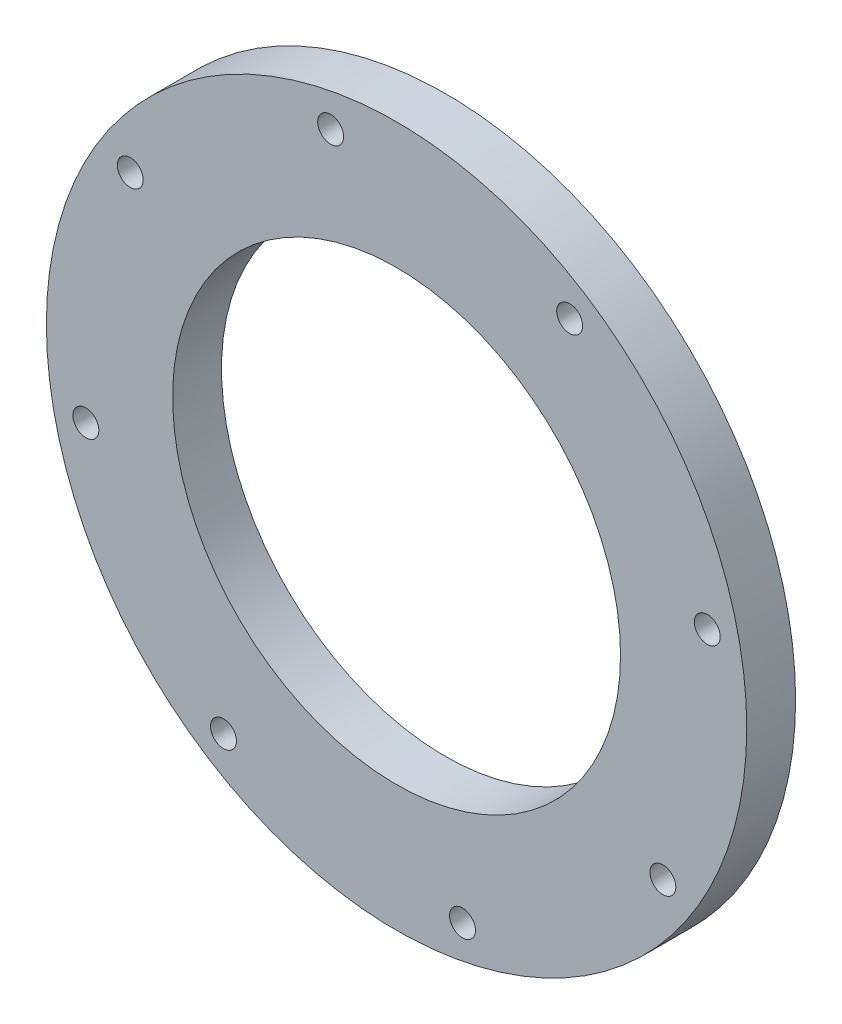
ISO-10303-21;
HEADER;
FILE_DESCRIPTION(('STEP AP214'),'2;1');
FILE_NAME('part.step','',(''),(''),'','','');
FILE_SCHEMA(('AUTOMOTIVE_DESIGN { 1 0 10303 214 1 1 1 1 }'));
ENDSEC;
DATA;
#1=APPLICATION_CONTEXT('core data for automotive mechanical design processes');
#2=APPLICATION_PROTOCOL_DEFINITION('international standard','automotive_design',2000,#1);
#3=PRODUCT_CONTEXT('',#1,'mechanical');
#4=PRODUCT('Part','Part','',(#3));
#5=PRODUCT_RELATED_PRODUCT_CATEGORY('part','',(#4));
#6=PRODUCT_DEFINITION_FORMATION('','',#4);
#7=PRODUCT_DEFINITION_CONTEXT('part definition',#1,'design');
#8=PRODUCT_DEFINITION('design','',#6,#7);
#9=PRODUCT_DEFINITION_SHAPE('','',#8);
#10=(LENGTH_UNIT() NAMED_UNIT(*) SI_UNIT(.MILLI.,.METRE.));
#11=(NAMED_UNIT(*) PLANE_ANGLE_UNIT() SI_UNIT($,.RADIAN.));
#12=(NAMED_UNIT(*) SI_UNIT($,.STERADIAN.) SOLID_ANGLE_UNIT());
#13=UNCERTAINTY_MEASURE_WITH_UNIT(LENGTH_MEASURE(1.E-05),#10,'distance_accuracy_value','');
#14=(GEOMETRIC_REPRESENTATION_CONTEXT(3) GLOBAL_UNCERTAINTY_ASSIGNED_CONTEXT((#13)) GLOBAL_UNIT_ASSIGNED_CONTEXT((#10,
#11,#12)) REPRESENTATION_CONTEXT('',''));
#15=CARTESIAN_POINT('',(0.,0.,0.));
#16=DIRECTION('',(0.,0.,1.));
#17=DIRECTION('',(1.,0.,0.));
#18=AXIS2_PLACEMENT_3D('',#15,#16,#17);
#19=CARTESIAN_POINT('',(0.,0.,7.62));
#20=DIRECTION('',(0.,0.,1.));
#21=DIRECTION('',(1.,0.,0.));
#22=AXIS2_PLACEMENT_3D('',#19,#20,#21);
#23=PLANE('',#22);
#24=CARTESIAN_POINT('',(-10.2805399774577,48.451330196104,7.62));
#25=DIRECTION('',(0.,0.,-1.));
#26=DIRECTION('',(-1.,0.,0.));
#27=AXIS2_PLACEMENT_3D('',#24,#25,#26);
#28=CIRCLE('',#27,2.01929999999999);
#29=CARTESIAN_POINT('',(-12.2998399774577,48.451330196104,7.62));
#30=VERTEX_POINT('',#29);
#31=EDGE_CURVE('E59',#30,#30,#28,.T.);
#32=ORIENTED_EDGE('',*,*,#31,.T.);
#33=EDGE_LOOP('',(#32));
#34=FACE_BOUND('',#33,.T.);
#35=CARTESIAN_POINT('',(26.990824606854,41.5297036714933,7.62));
#36=DIRECTION('',(0.,0.,-1.));
#37=DIRECTION('',(-1.,0.,0.));
#38=AXIS2_PLACEMENT_3D('',#35,#36,#37);
#39=CIRCLE('',#38,2.01929999999998);
#40=CARTESIAN_POINT('',(24.971524606854,41.5297036714933,7.62));
#41=VERTEX_POINT('',#40);
#42=EDGE_CURVE('E78',#41,#41,#39,.T.);
#43=ORIENTED_EDGE('',*,*,#42,.T.);
#44=EDGE_LOOP('',(#43));
#45=FACE_BOUND('',#44,.T.);
#46=CARTESIAN_POINT('',(48.451330196104,10.2805399774576,7.62));
#47=DIRECTION('',(0.,0.,-1.));
#48=DIRECTION('',(-1.,0.,0.));
#49=AXIS2_PLACEMENT_3D('',#46,#47,#48);
#50=CIRCLE('',#49,2.01929999999999);
#51=CARTESIAN_POINT('',(46.432030196104,10.2805399774576,7.62));
#52=VERTEX_POINT('',#51);
#53=EDGE_CURVE('E72',#52,#52,#50,.T.);
#54=ORIENTED_EDGE('',*,*,#53,.T.);
#55=EDGE_LOOP('',(#54));
#56=FACE_BOUND('',#55,.T.);
#57=CARTESIAN_POINT('',(41.5297036714934,-26.9908246068541,7.62));
#58=DIRECTION('',(0.,0.,-1.));
#59=DIRECTION('',(-1.,0.,0.));
#60=AXIS2_PLACEMENT_3D('',#57,#58,#59);
#61=CIRCLE('',#60,2.01930000000006);
#62=CARTESIAN_POINT('',(39.5104036714933,-26.9908246068541,7.62));
#63=VERTEX_POINT('',#62);
#64=EDGE_CURVE('E65',#63,#63,#61,.T.);
#65=ORIENTED_EDGE('',*,*,#64,.T.);
#66=EDGE_LOOP('',(#65));
#67=FACE_BOUND('',#66,.T.);
#68=CARTESIAN_POINT('',(10.2805399774576,-48.4513301961042,7.62));
#69=DIRECTION('',(0.,0.,-1.));
#70=DIRECTION('',(-1.,0.,0.));
#71=AXIS2_PLACEMENT_3D('',#68,#69,#70);
#72=CIRCLE('',#71,2.01930000000019);
#73=CARTESIAN_POINT('',(8.26123997745744,-48.4513301961042,7.62));
#74=VERTEX_POINT('',#73);
#75=EDGE_CURVE('E66',#74,#74,#72,.T.);
#76=ORIENTED_EDGE('',*,*,#75,.T.);
#77=EDGE_LOOP('',(#76));
#78=FACE_BOUND('',#77,.T.);
#79=CARTESIAN_POINT('',(-26.990824606854,-41.5297036714935,7.62));
#80=DIRECTION('',(0.,0.,-1.));
#81=DIRECTION('',(-1.,0.,0.));
#82=AXIS2_PLACEMENT_3D('',#79,#80,#81);
#83=CIRCLE('',#82,2.01930000000035);
#84=CARTESIAN_POINT('',(-29.0101246068544,-41.5297036714935,7.62));
#85=VERTEX_POINT('',#84);
#86=EDGE_CURVE('E95',#85,#85,#83,.T.);
#87=ORIENTED_EDGE('',*,*,#86,.T.);
#88=EDGE_LOOP('',(#87));
#89=FACE_BOUND('',#88,.T.);
#90=CARTESIAN_POINT('',(-48.4513301961041,-10.2805399774578,7.62));
#91=DIRECTION('',(0.,0.,-1.));
#92=DIRECTION('',(-1.,0.,0.));
#93=AXIS2_PLACEMENT_3D('',#90,#91,#92);
#94=CIRCLE('',#93,2.01930000000052);
#95=CARTESIAN_POINT('',(-50.4706301961046,-10.2805399774578,7.62));
#96=VERTEX_POINT('',#95);
#97=EDGE_CURVE('E89',#96,#96,#94,.T.);
#98=ORIENTED_EDGE('',*,*,#97,.T.);
#99=EDGE_LOOP('',(#98));
#100=FACE_BOUND('',#99,.T.);
#101=CARTESIAN_POINT('',(-41.5297036714928,26.990824606853,7.62));
#102=DIRECTION('',(0.,0.,-1.));
#103=DIRECTION('',(-1.,0.,0.));
#104=AXIS2_PLACEMENT_3D('',#101,#102,#103);
#105=CIRCLE('',#104,2.01930000000109);
#106=CARTESIAN_POINT('',(-43.5490036714939,26.990824606853,7.62));
#107=VERTEX_POINT('',#106);
#108=EDGE_CURVE('E53',#107,#107,#105,.T.);
#109=ORIENTED_EDGE('',*,*,#108,.T.);
#110=EDGE_LOOP('',(#109));
#111=FACE_BOUND('',#110,.T.);
#112=CARTESIAN_POINT('',(0.,0.,7.62));
#113=DIRECTION('',(0.,0.,1.));
#114=DIRECTION('',(1.,0.,0.));
#115=AXIS2_PLACEMENT_3D('',#112,#113,#114);
#116=CIRCLE('',#115,54.61);
#117=CARTESIAN_POINT('',(54.61,0.,7.62));
#118=VERTEX_POINT('',#117);
#119=EDGE_CURVE('E10',#118,#118,#116,.T.);
#120=ORIENTED_EDGE('',*,*,#119,.T.);
#121=EDGE_LOOP('',(#120));
#122=FACE_BOUND('',#121,.T.);
#123=CARTESIAN_POINT('',(0.,0.,7.62));
#124=DIRECTION('',(0.,0.,1.));
#125=DIRECTION('',(1.,0.,0.));
#126=AXIS2_PLACEMENT_3D('',#123,#124,#125);
#127=CIRCLE('',#126,34.925);
#128=CARTESIAN_POINT('',(34.925,0.,7.62));
#129=VERTEX_POINT('',#128);
#130=EDGE_CURVE('E48',#129,#129,#127,.T.);
#131=ORIENTED_EDGE('',*,*,#130,.F.);
#132=EDGE_LOOP('',(#131));
#133=FACE_BOUND('',#132,.T.);
#134=ADVANCED_FACE('F37',(#34,#45,#56,#67,#78,#89,#100,#111,#122,#133),#23,.T.);
#135=CARTESIAN_POINT('',(0.,0.,0.));
#136=DIRECTION('',(0.,0.,1.));
#137=DIRECTION('',(1.,0.,0.));
#138=AXIS2_PLACEMENT_3D('',#135,#136,#137);
#139=PLANE('',#138);
#140=CARTESIAN_POINT('',(-10.2805399774577,48.451330196104,0.));
#141=DIRECTION('',(0.,0.,-1.));
#142=DIRECTION('',(-1.,0.,0.));
#143=AXIS2_PLACEMENT_3D('',#140,#141,#142);
#144=CIRCLE('',#143,2.01929999999999);
#145=CARTESIAN_POINT('',(-12.2998399774577,48.451330196104,0.));
#146=VERTEX_POINT('',#145);
#147=EDGE_CURVE('E81',#146,#146,#144,.T.);
#148=ORIENTED_EDGE('',*,*,#147,.F.);
#149=EDGE_LOOP('',(#148));
#150=FACE_BOUND('',#149,.T.);
#151=CARTESIAN_POINT('',(26.990824606854,41.5297036714933,0.));
#152=DIRECTION('',(0.,0.,-1.));
#153=DIRECTION('',(-1.,0.,0.));
#154=AXIS2_PLACEMENT_3D('',#151,#152,#153);
#155=CIRCLE('',#154,2.01929999999998);
#156=CARTESIAN_POINT('',(24.971524606854,41.5297036714933,0.));
#157=VERTEX_POINT('',#156);
#158=EDGE_CURVE('E75',#157,#157,#155,.T.);
#159=ORIENTED_EDGE('',*,*,#158,.F.);
#160=EDGE_LOOP('',(#159));
#161=FACE_BOUND('',#160,.T.);
#162=CARTESIAN_POINT('',(48.451330196104,10.2805399774576,0.));
#163=DIRECTION('',(0.,0.,-1.));
#164=DIRECTION('',(-1.,0.,0.));
#165=AXIS2_PLACEMENT_3D('',#162,#163,#164);
#166=CIRCLE('',#165,2.01929999999999);
#167=CARTESIAN_POINT('',(46.432030196104,10.2805399774576,0.));
#168=VERTEX_POINT('',#167);
#169=EDGE_CURVE('E69',#168,#168,#166,.T.);
#170=ORIENTED_EDGE('',*,*,#169,.F.);
#171=EDGE_LOOP('',(#170));
#172=FACE_BOUND('',#171,.T.);
#173=CARTESIAN_POINT('',(41.5297036714934,-26.9908246068541,0.));
#174=DIRECTION('',(0.,0.,-1.));
#175=DIRECTION('',(-1.,0.,0.));
#176=AXIS2_PLACEMENT_3D('',#173,#174,#175);
#177=CIRCLE('',#176,2.01930000000006);
#178=CARTESIAN_POINT('',(39.5104036714933,-26.9908246068541,0.));
#179=VERTEX_POINT('',#178);
#180=EDGE_CURVE('E62',#179,#179,#177,.T.);
#181=ORIENTED_EDGE('',*,*,#180,.F.);
#182=EDGE_LOOP('',(#181));
#183=FACE_BOUND('',#182,.T.);
#184=CARTESIAN_POINT('',(10.2805399774576,-48.4513301961042,0.));
#185=DIRECTION('',(0.,0.,-1.));
#186=DIRECTION('',(-1.,0.,0.));
#187=AXIS2_PLACEMENT_3D('',#184,#185,#186);
#188=CIRCLE('',#187,2.01930000000019);
#189=CARTESIAN_POINT('',(8.26123997745744,-48.4513301961042,0.));
#190=VERTEX_POINT('',#189);
#191=EDGE_CURVE('E98',#190,#190,#188,.T.);
#192=ORIENTED_EDGE('',*,*,#191,.F.);
#193=EDGE_LOOP('',(#192));
#194=FACE_BOUND('',#193,.T.);
#195=CARTESIAN_POINT('',(-26.990824606854,-41.5297036714935,0.));
#196=DIRECTION('',(0.,0.,-1.));
#197=DIRECTION('',(-1.,0.,0.));
#198=AXIS2_PLACEMENT_3D('',#195,#196,#197);
#199=CIRCLE('',#198,2.01930000000035);
#200=CARTESIAN_POINT('',(-29.0101246068544,-41.5297036714935,0.));
#201=VERTEX_POINT('',#200);
#202=EDGE_CURVE('E92',#201,#201,#199,.T.);
#203=ORIENTED_EDGE('',*,*,#202,.F.);
#204=EDGE_LOOP('',(#203));
#205=FACE_BOUND('',#204,.T.);
#206=CARTESIAN_POINT('',(-48.4513301961041,-10.2805399774578,0.));
#207=DIRECTION('',(0.,0.,-1.));
#208=DIRECTION('',(-1.,0.,0.));
#209=AXIS2_PLACEMENT_3D('',#206,#207,#208);
#210=CIRCLE('',#209,2.01930000000052);
#211=CARTESIAN_POINT('',(-50.4706301961046,-10.2805399774578,0.));
#212=VERTEX_POINT('',#211);
#213=EDGE_CURVE('E86',#212,#212,#210,.T.);
#214=ORIENTED_EDGE('',*,*,#213,.F.);
#215=EDGE_LOOP('',(#214));
#216=FACE_BOUND('',#215,.T.);
#217=CARTESIAN_POINT('',(-41.5297036714928,26.990824606853,0.));
#218=DIRECTION('',(0.,0.,-1.));
#219=DIRECTION('',(-1.,0.,0.));
#220=AXIS2_PLACEMENT_3D('',#217,#218,#219);
#221=CIRCLE('',#220,2.01930000000109);
#222=CARTESIAN_POINT('',(-43.5490036714939,26.990824606853,0.));
#223=VERTEX_POINT('',#222);
#224=EDGE_CURVE('E56',#223,#223,#221,.T.);
#225=ORIENTED_EDGE('',*,*,#224,.F.);
#226=EDGE_LOOP('',(#225));
#227=FACE_BOUND('',#226,.T.);
#228=CARTESIAN_POINT('',(0.,0.,0.));
#229=DIRECTION('',(0.,0.,1.));
#230=DIRECTION('',(1.,0.,0.));
#231=AXIS2_PLACEMENT_3D('',#228,#229,#230);
#232=CIRCLE('',#231,54.61);
#233=CARTESIAN_POINT('',(54.61,0.,0.));
#234=VERTEX_POINT('',#233);
#235=EDGE_CURVE('E41',#234,#234,#232,.T.);
#236=ORIENTED_EDGE('',*,*,#235,.F.);
#237=EDGE_LOOP('',(#236));
#238=FACE_BOUND('',#237,.T.);
#239=CARTESIAN_POINT('',(0.,0.,0.));
#240=DIRECTION('',(0.,0.,1.));
#241=DIRECTION('',(1.,0.,0.));
#242=AXIS2_PLACEMENT_3D('',#239,#240,#241);
#243=CIRCLE('',#242,34.925);
#244=CARTESIAN_POINT('',(34.925,0.,0.));
#245=VERTEX_POINT('',#244);
#246=EDGE_CURVE('E50',#245,#245,#243,.T.);
#247=ORIENTED_EDGE('',*,*,#246,.T.);
#248=EDGE_LOOP('',(#247));
#249=FACE_BOUND('',#248,.T.);
#250=ADVANCED_FACE('F114',(#150,#161,#172,#183,#194,#205,#216,#227,#238,#249),#139,.F.);
#251=CARTESIAN_POINT('',(0.,0.,7.62));
#252=DIRECTION('',(0.,0.,-1.));
#253=DIRECTION('',(-1.,0.,0.));
#254=AXIS2_PLACEMENT_3D('',#251,#252,#253);
#255=CYLINDRICAL_SURFACE('',#254,54.61);
#256=ORIENTED_EDGE('',*,*,#119,.F.);
#257=EDGE_LOOP('',(#256));
#258=FACE_BOUND('',#257,.T.);
#259=ORIENTED_EDGE('',*,*,#235,.T.);
#260=EDGE_LOOP('',(#259));
#261=FACE_BOUND('',#260,.T.);
#262=ADVANCED_FACE('F39',(#258,#261),#255,.T.);
#263=CARTESIAN_POINT('',(0.,0.,7.62));
#264=DIRECTION('',(0.,0.,-1.));
#265=DIRECTION('',(-1.,0.,0.));
#266=AXIS2_PLACEMENT_3D('',#263,#264,#265);
#267=CYLINDRICAL_SURFACE('',#266,34.925);
#268=ORIENTED_EDGE('',*,*,#130,.T.);
#269=EDGE_LOOP('',(#268));
#270=FACE_BOUND('',#269,.T.);
#271=ORIENTED_EDGE('',*,*,#246,.F.);
#272=EDGE_LOOP('',(#271));
#273=FACE_BOUND('',#272,.T.);
#274=ADVANCED_FACE('F128',(#270,#273),#267,.F.);
#275=CARTESIAN_POINT('',(-41.5297036714928,26.990824606853,7.62));
#276=DIRECTION('',(0.,0.,-1.));
#277=DIRECTION('',(-1.,0.,0.));
#278=AXIS2_PLACEMENT_3D('',#275,#276,#277);
#279=CYLINDRICAL_SURFACE('',#278,2.01930000000109);
#280=ORIENTED_EDGE('',*,*,#108,.F.);
#281=EDGE_LOOP('',(#280));
#282=FACE_BOUND('',#281,.T.);
#283=ORIENTED_EDGE('',*,*,#224,.T.);
#284=EDGE_LOOP('',(#283));
#285=FACE_BOUND('',#284,.T.);
#286=ADVANCED_FACE('F130',(#282,#285),#279,.F.);
#287=CARTESIAN_POINT('',(-48.4513301961041,-10.2805399774578,7.62));
#288=DIRECTION('',(0.,0.,-1.));
#289=DIRECTION('',(-1.,0.,0.));
#290=AXIS2_PLACEMENT_3D('',#287,#288,#289);
#291=CYLINDRICAL_SURFACE('',#290,2.01930000000052);
#292=ORIENTED_EDGE('',*,*,#97,.F.);
#293=EDGE_LOOP('',(#292));
#294=FACE_BOUND('',#293,.T.);
#295=ORIENTED_EDGE('',*,*,#213,.T.);
#296=EDGE_LOOP('',(#295));
#297=FACE_BOUND('',#296,.T.);
#298=ADVANCED_FACE('F137',(#294,#297),#291,.F.);
#299=CARTESIAN_POINT('',(-26.990824606854,-41.5297036714935,7.62));
#300=DIRECTION('',(0.,0.,-1.));
#301=DIRECTION('',(-1.,0.,0.));
#302=AXIS2_PLACEMENT_3D('',#299,#300,#301);
#303=CYLINDRICAL_SURFACE('',#302,2.01930000000035);
#304=ORIENTED_EDGE('',*,*,#86,.F.);
#305=EDGE_LOOP('',(#304));
#306=FACE_BOUND('',#305,.T.);
#307=ORIENTED_EDGE('',*,*,#202,.T.);
#308=EDGE_LOOP('',(#307));
#309=FACE_BOUND('',#308,.T.);
#310=ADVANCED_FACE('F110',(#306,#309),#303,.F.);
#311=CARTESIAN_POINT('',(10.2805399774576,-48.4513301961042,7.62));
#312=DIRECTION('',(0.,0.,-1.));
#313=DIRECTION('',(-1.,0.,0.));
#314=AXIS2_PLACEMENT_3D('',#311,#312,#313);
#315=CYLINDRICAL_SURFACE('',#314,2.01930000000019);
#316=ORIENTED_EDGE('',*,*,#75,.F.);
#317=EDGE_LOOP('',(#316));
#318=FACE_BOUND('',#317,.T.);
#319=ORIENTED_EDGE('',*,*,#191,.T.);
#320=EDGE_LOOP('',(#319));
#321=FACE_BOUND('',#320,.T.);
#322=ADVANCED_FACE('F106',(#318,#321),#315,.F.);
#323=CARTESIAN_POINT('',(41.5297036714934,-26.9908246068541,7.62));
#324=DIRECTION('',(0.,0.,-1.));
#325=DIRECTION('',(-1.,0.,0.));
#326=AXIS2_PLACEMENT_3D('',#323,#324,#325);
#327=CYLINDRICAL_SURFACE('',#326,2.01930000000006);
#328=ORIENTED_EDGE('',*,*,#64,.F.);
#329=EDGE_LOOP('',(#328));
#330=FACE_BOUND('',#329,.T.);
#331=ORIENTED_EDGE('',*,*,#180,.T.);
#332=EDGE_LOOP('',(#331));
#333=FACE_BOUND('',#332,.T.);
#334=ADVANCED_FACE('F109',(#330,#333),#327,.F.);
#335=CARTESIAN_POINT('',(48.451330196104,10.2805399774576,7.62));
#336=DIRECTION('',(0.,0.,-1.));
#337=DIRECTION('',(-1.,0.,0.));
#338=AXIS2_PLACEMENT_3D('',#335,#336,#337);
#339=CYLINDRICAL_SURFACE('',#338,2.01929999999999);
#340=ORIENTED_EDGE('',*,*,#53,.F.);
#341=EDGE_LOOP('',(#340));
#342=FACE_BOUND('',#341,.T.);
#343=ORIENTED_EDGE('',*,*,#169,.T.);
#344=EDGE_LOOP('',(#343));
#345=FACE_BOUND('',#344,.T.);
#346=ADVANCED_FACE('F156',(#342,#345),#339,.F.);
#347=CARTESIAN_POINT('',(26.990824606854,41.5297036714933,7.62));
#348=DIRECTION('',(0.,0.,-1.));
#349=DIRECTION('',(-1.,0.,0.));
#350=AXIS2_PLACEMENT_3D('',#347,#348,#349);
#351=CYLINDRICAL_SURFACE('',#350,2.01929999999998);
#352=ORIENTED_EDGE('',*,*,#42,.F.);
#353=EDGE_LOOP('',(#352));
#354=FACE_BOUND('',#353,.T.);
#355=ORIENTED_EDGE('',*,*,#158,.T.);
#356=EDGE_LOOP('',(#355));
#357=FACE_BOUND('',#356,.T.);
#358=ADVANCED_FACE('F163',(#354,#357),#351,.F.);
#359=CARTESIAN_POINT('',(-10.2805399774577,48.451330196104,7.62));
#360=DIRECTION('',(0.,0.,-1.));
#361=DIRECTION('',(-1.,0.,0.));
#362=AXIS2_PLACEMENT_3D('',#359,#360,#361);
#363=CYLINDRICAL_SURFACE('',#362,2.01929999999999);
#364=ORIENTED_EDGE('',*,*,#31,.F.);
#365=EDGE_LOOP('',(#364));
#366=FACE_BOUND('',#365,.T.);
#367=ORIENTED_EDGE('',*,*,#147,.T.);
#368=EDGE_LOOP('',(#367));
#369=FACE_BOUND('',#368,.T.);
#370=ADVANCED_FACE('F169',(#366,#369),#363,.F.);
#371=CLOSED_SHELL('',(#134,#250,#262,#274,#286,#298,#310,#322,#334,#346,#358,#370));
#372=MANIFOLD_SOLID_BREP('B2',#371);
#373=ADVANCED_BREP_SHAPE_REPRESENTATION('',(#18,#372),#14);
#374=SHAPE_DEFINITION_REPRESENTATION(#9,#373);
ENDSEC;
END-ISO-10303-21;
